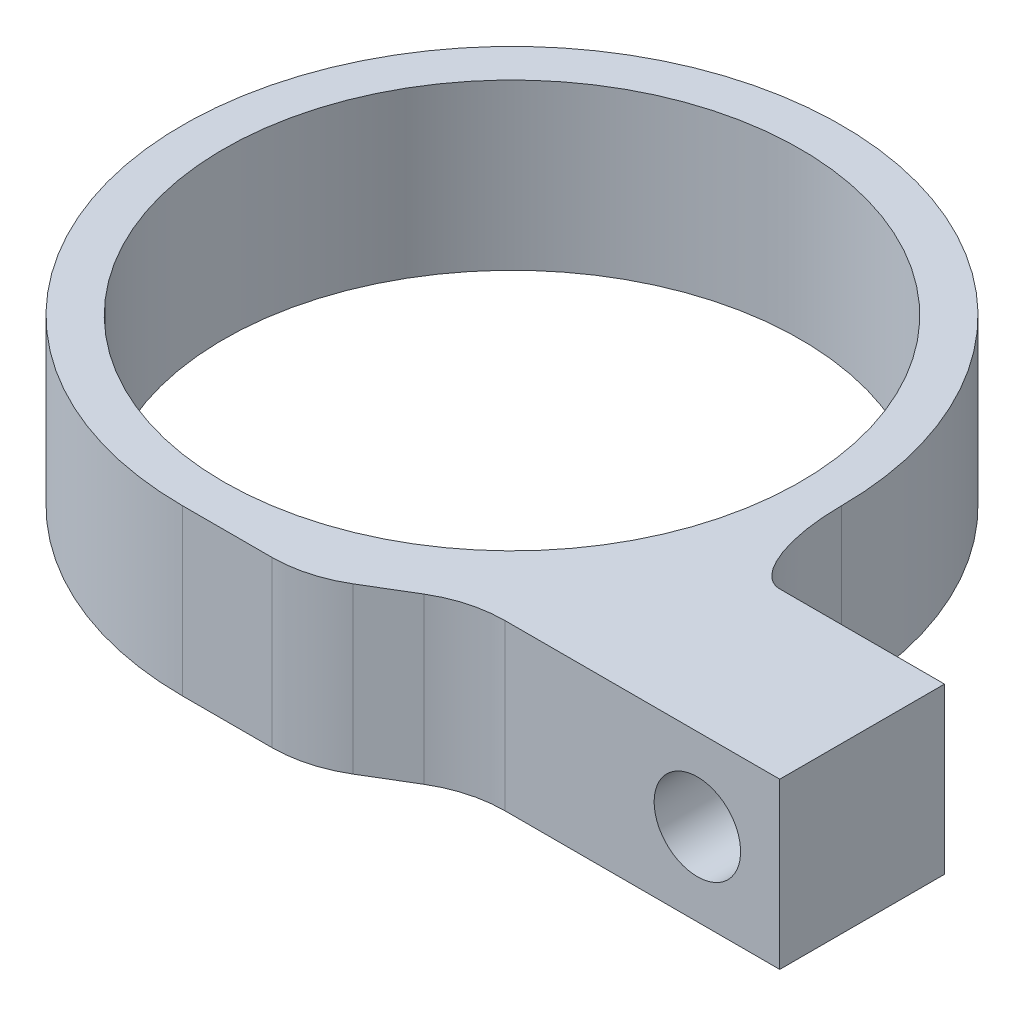
ISO-10303-21;
HEADER;
FILE_DESCRIPTION(('STEP AP214'),'2;1');
FILE_NAME('part.step','',(''),(''),'','','');
FILE_SCHEMA(('AUTOMOTIVE_DESIGN { 1 0 10303 214 1 1 1 1 }'));
ENDSEC;
DATA;
#1=APPLICATION_CONTEXT('core data for automotive mechanical design processes');
#2=APPLICATION_PROTOCOL_DEFINITION('international standard','automotive_design',2000,#1);
#3=PRODUCT_CONTEXT('',#1,'mechanical');
#4=PRODUCT('Part','Part','',(#3));
#5=PRODUCT_RELATED_PRODUCT_CATEGORY('part','',(#4));
#6=PRODUCT_DEFINITION_FORMATION('','',#4);
#7=PRODUCT_DEFINITION_CONTEXT('part definition',#1,'design');
#8=PRODUCT_DEFINITION('design','',#6,#7);
#9=PRODUCT_DEFINITION_SHAPE('','',#8);
#10=(LENGTH_UNIT() NAMED_UNIT(*) SI_UNIT(.MILLI.,.METRE.));
#11=(NAMED_UNIT(*) PLANE_ANGLE_UNIT() SI_UNIT($,.RADIAN.));
#12=(NAMED_UNIT(*) SI_UNIT($,.STERADIAN.) SOLID_ANGLE_UNIT());
#13=UNCERTAINTY_MEASURE_WITH_UNIT(LENGTH_MEASURE(1.E-05),#10,'distance_accuracy_value','');
#14=(GEOMETRIC_REPRESENTATION_CONTEXT(3) GLOBAL_UNCERTAINTY_ASSIGNED_CONTEXT((#13)) GLOBAL_UNIT_ASSIGNED_CONTEXT((#10,
#11,#12)) REPRESENTATION_CONTEXT('',''));
#15=CARTESIAN_POINT('',(0.,0.,0.));
#16=DIRECTION('',(0.,0.,1.));
#17=DIRECTION('',(1.,0.,0.));
#18=AXIS2_PLACEMENT_3D('',#15,#16,#17);
#19=CARTESIAN_POINT('',(0.,8.,0.));
#20=DIRECTION('',(0.,1.,0.));
#21=DIRECTION('',(0.,0.,1.));
#22=AXIS2_PLACEMENT_3D('',#19,#20,#21);
#23=PLANE('',#22);
#24=DIRECTION('',(1.,0.,0.));
#25=VECTOR('',#24,1.);
#26=CARTESIAN_POINT('',(0.,8.,16.));
#27=LINE('',#26,#25);
#28=CARTESIAN_POINT('',(0.,8.,16.));
#29=VERTEX_POINT('',#28);
#30=CARTESIAN_POINT('',(4.3380962103094,8.,16.));
#31=VERTEX_POINT('',#30);
#32=EDGE_CURVE('E120',#29,#31,#27,.T.);
#33=ORIENTED_EDGE('',*,*,#32,.T.);
#34=CARTESIAN_POINT('',(4.3380962103094,8.,10.));
#35=DIRECTION('',(0.,1.,0.));
#36=DIRECTION('',(0.,0.,1.));
#37=AXIS2_PLACEMENT_3D('',#34,#35,#36);
#38=CIRCLE('',#37,6.);
#39=CARTESIAN_POINT('',(7.42507074287456,8.,15.1449575542753));
#40=VERTEX_POINT('',#39);
#41=EDGE_CURVE('E163',#31,#40,#38,.T.);
#42=ORIENTED_EDGE('',*,*,#41,.T.);
#43=DIRECTION('',(0.857492925712544,0.,-0.514495755427526));
#44=VECTOR('',#43,1.);
#45=CARTESIAN_POINT('',(6.,8.,16.));
#46=LINE('',#45,#44);
#47=CARTESIAN_POINT('',(9.57492925712543,8.,13.8550424457247));
#48=VERTEX_POINT('',#47);
#49=EDGE_CURVE('E131',#40,#48,#46,.T.);
#50=ORIENTED_EDGE('',*,*,#49,.T.);
#51=CARTESIAN_POINT('',(12.6619037896906,8.,19.));
#52=DIRECTION('',(0.,1.,0.));
#53=DIRECTION('',(0.,0.,1.));
#54=AXIS2_PLACEMENT_3D('',#51,#52,#53);
#55=CIRCLE('',#54,6.);
#56=CARTESIAN_POINT('',(12.6619037896906,8.,13.));
#57=VERTEX_POINT('',#56);
#58=EDGE_CURVE('E167',#48,#57,#55,.F.);
#59=ORIENTED_EDGE('',*,*,#58,.T.);
#60=DIRECTION('',(1.,0.,0.));
#61=VECTOR('',#60,1.);
#62=CARTESIAN_POINT('',(11.,8.,13.));
#63=LINE('',#62,#61);
#64=CARTESIAN_POINT('',(26.,8.,13.));
#65=VERTEX_POINT('',#64);
#66=EDGE_CURVE('E181',#57,#65,#63,.T.);
#67=ORIENTED_EDGE('',*,*,#66,.T.);
#68=DIRECTION('',(0.,0.,-1.));
#69=VECTOR('',#68,1.);
#70=CARTESIAN_POINT('',(26.,8.,13.));
#71=LINE('',#70,#69);
#72=CARTESIAN_POINT('',(26.,8.,5.));
#73=VERTEX_POINT('',#72);
#74=EDGE_CURVE('E180',#65,#73,#71,.T.);
#75=ORIENTED_EDGE('',*,*,#74,.T.);
#76=DIRECTION('',(-1.,0.,0.));
#77=VECTOR('',#76,1.);
#78=CARTESIAN_POINT('',(26.,8.,5.));
#79=LINE('',#78,#77);
#80=CARTESIAN_POINT('',(18.,8.,5.));
#81=VERTEX_POINT('',#80);
#82=EDGE_CURVE('E172',#73,#81,#79,.T.);
#83=ORIENTED_EDGE('',*,*,#82,.T.);
#84=CARTESIAN_POINT('',(16.,8.,0.));
#85=CARTESIAN_POINT('',(16.,8.,5.));
#86=CARTESIAN_POINT('',(18.,8.,5.));
#87=(BOUNDED_CURVE() B_SPLINE_CURVE(2,(#84,#85,#86),.UNSPECIFIED.,.F.,
.F.) B_SPLINE_CURVE_WITH_KNOTS((3,3),(0.,1.),
.UNSPECIFIED.) CURVE() GEOMETRIC_REPRESENTATION_ITEM() RATIONAL_B_SPLINE_CURVE((1.,
0.707106781186548,1.)) REPRESENTATION_ITEM(''));
#88=CARTESIAN_POINT('',(16.,8.,0.));
#89=VERTEX_POINT('',#88);
#90=EDGE_CURVE('E12',#81,#89,#87,.F.);
#91=ORIENTED_EDGE('',*,*,#90,.T.);
#92=CARTESIAN_POINT('',(0.,8.,0.));
#93=DIRECTION('',(0.,1.,0.));
#94=DIRECTION('',(0.,0.,1.));
#95=AXIS2_PLACEMENT_3D('',#92,#93,#94);
#96=CIRCLE('',#95,16.);
#97=EDGE_CURVE('E132',#89,#29,#96,.T.);
#98=ORIENTED_EDGE('',*,*,#97,.T.);
#99=EDGE_LOOP('',(#33,#42,#50,#59,#67,#75,#83,#91,#98));
#100=FACE_BOUND('',#99,.T.);
#101=CARTESIAN_POINT('',(0.,8.,0.));
#102=DIRECTION('',(0.,1.,0.));
#103=DIRECTION('',(0.,0.,1.));
#104=AXIS2_PLACEMENT_3D('',#101,#102,#103);
#105=CIRCLE('',#104,14.);
#106=CARTESIAN_POINT('',(0.,8.,14.));
#107=VERTEX_POINT('',#106);
#108=EDGE_CURVE('E273',#107,#107,#105,.T.);
#109=ORIENTED_EDGE('',*,*,#108,.F.);
#110=EDGE_LOOP('',(#109));
#111=FACE_BOUND('',#110,.T.);
#112=ADVANCED_FACE('F40',(#100,#111),#23,.T.);
#113=CARTESIAN_POINT('',(0.,0.,0.));
#114=DIRECTION('',(0.,1.,0.));
#115=DIRECTION('',(0.,0.,1.));
#116=AXIS2_PLACEMENT_3D('',#113,#114,#115);
#117=PLANE('',#116);
#118=DIRECTION('',(0.857492925712544,0.,-0.514495755427526));
#119=VECTOR('',#118,1.);
#120=CARTESIAN_POINT('',(6.,0.,16.));
#121=LINE('',#120,#119);
#122=CARTESIAN_POINT('',(7.42507074287456,0.,15.1449575542753));
#123=VERTEX_POINT('',#122);
#124=CARTESIAN_POINT('',(9.57492925712543,0.,13.8550424457247));
#125=VERTEX_POINT('',#124);
#126=EDGE_CURVE('E190',#123,#125,#121,.T.);
#127=ORIENTED_EDGE('',*,*,#126,.F.);
#128=CARTESIAN_POINT('',(4.3380962103094,0.,10.));
#129=DIRECTION('',(0.,1.,0.));
#130=DIRECTION('',(0.,0.,1.));
#131=AXIS2_PLACEMENT_3D('',#128,#129,#130);
#132=CIRCLE('',#131,6.);
#133=CARTESIAN_POINT('',(4.3380962103094,0.,16.));
#134=VERTEX_POINT('',#133);
#135=EDGE_CURVE('E160',#123,#134,#132,.F.);
#136=ORIENTED_EDGE('',*,*,#135,.T.);
#137=DIRECTION('',(1.,0.,0.));
#138=VECTOR('',#137,1.);
#139=CARTESIAN_POINT('',(0.,0.,16.));
#140=LINE('',#139,#138);
#141=CARTESIAN_POINT('',(0.,0.,16.));
#142=VERTEX_POINT('',#141);
#143=EDGE_CURVE('E188',#142,#134,#140,.T.);
#144=ORIENTED_EDGE('',*,*,#143,.F.);
#145=CARTESIAN_POINT('',(0.,0.,0.));
#146=DIRECTION('',(0.,1.,0.));
#147=DIRECTION('',(0.,0.,1.));
#148=AXIS2_PLACEMENT_3D('',#145,#146,#147);
#149=CIRCLE('',#148,16.);
#150=CARTESIAN_POINT('',(16.,0.,0.));
#151=VERTEX_POINT('',#150);
#152=EDGE_CURVE('E144',#151,#142,#149,.T.);
#153=ORIENTED_EDGE('',*,*,#152,.F.);
#154=CARTESIAN_POINT('',(18.,0.,5.));
#155=CARTESIAN_POINT('',(16.,0.,5.));
#156=CARTESIAN_POINT('',(16.,0.,0.));
#157=(BOUNDED_CURVE() B_SPLINE_CURVE(2,(#154,#155,#156),.UNSPECIFIED.,.F.,
.F.) B_SPLINE_CURVE_WITH_KNOTS((3,3),(0.,1.),
.UNSPECIFIED.) CURVE() GEOMETRIC_REPRESENTATION_ITEM() RATIONAL_B_SPLINE_CURVE((1.,
0.707106781186548,1.)) REPRESENTATION_ITEM(''));
#158=CARTESIAN_POINT('',(18.,0.,5.));
#159=VERTEX_POINT('',#158);
#160=EDGE_CURVE('E55',#151,#159,#157,.F.);
#161=ORIENTED_EDGE('',*,*,#160,.T.);
#162=DIRECTION('',(-1.,0.,0.));
#163=VECTOR('',#162,1.);
#164=CARTESIAN_POINT('',(26.,0.,5.));
#165=LINE('',#164,#163);
#166=CARTESIAN_POINT('',(26.,0.,5.));
#167=VERTEX_POINT('',#166);
#168=EDGE_CURVE('E141',#167,#159,#165,.T.);
#169=ORIENTED_EDGE('',*,*,#168,.F.);
#170=DIRECTION('',(0.,0.,-1.));
#171=VECTOR('',#170,1.);
#172=CARTESIAN_POINT('',(26.,0.,13.));
#173=LINE('',#172,#171);
#174=CARTESIAN_POINT('',(26.,0.,13.));
#175=VERTEX_POINT('',#174);
#176=EDGE_CURVE('E171',#175,#167,#173,.T.);
#177=ORIENTED_EDGE('',*,*,#176,.F.);
#178=DIRECTION('',(1.,0.,0.));
#179=VECTOR('',#178,1.);
#180=CARTESIAN_POINT('',(11.,0.,13.));
#181=LINE('',#180,#179);
#182=CARTESIAN_POINT('',(12.6619037896906,0.,13.));
#183=VERTEX_POINT('',#182);
#184=EDGE_CURVE('E192',#183,#175,#181,.T.);
#185=ORIENTED_EDGE('',*,*,#184,.F.);
#186=CARTESIAN_POINT('',(12.6619037896906,0.,19.));
#187=DIRECTION('',(0.,1.,0.));
#188=DIRECTION('',(0.,0.,1.));
#189=AXIS2_PLACEMENT_3D('',#186,#187,#188);
#190=CIRCLE('',#189,6.);
#191=EDGE_CURVE('E165',#183,#125,#190,.T.);
#192=ORIENTED_EDGE('',*,*,#191,.T.);
#193=EDGE_LOOP('',(#127,#136,#144,#153,#161,#169,#177,#185,#192));
#194=FACE_BOUND('',#193,.T.);
#195=CARTESIAN_POINT('',(0.,0.,0.));
#196=DIRECTION('',(0.,1.,0.));
#197=DIRECTION('',(0.,0.,1.));
#198=AXIS2_PLACEMENT_3D('',#195,#196,#197);
#199=CIRCLE('',#198,14.);
#200=CARTESIAN_POINT('',(0.,0.,14.));
#201=VERTEX_POINT('',#200);
#202=EDGE_CURVE('E276',#201,#201,#199,.T.);
#203=ORIENTED_EDGE('',*,*,#202,.T.);
#204=EDGE_LOOP('',(#203));
#205=FACE_BOUND('',#204,.T.);
#206=ADVANCED_FACE('F200',(#194,#205),#117,.F.);
#207=CARTESIAN_POINT('',(0.,8.,0.));
#208=DIRECTION('',(0.,-1.,0.));
#209=DIRECTION('',(0.,0.,-1.));
#210=AXIS2_PLACEMENT_3D('',#207,#208,#209);
#211=CYLINDRICAL_SURFACE('',#210,16.);
#212=ORIENTED_EDGE('',*,*,#152,.T.);
#213=DIRECTION('',(0.,-1.,0.));
#214=VECTOR('',#213,1.);
#215=CARTESIAN_POINT('',(0.,8.,16.));
#216=LINE('',#215,#214);
#217=EDGE_CURVE('E125',#29,#142,#216,.T.);
#218=ORIENTED_EDGE('',*,*,#217,.F.);
#219=ORIENTED_EDGE('',*,*,#97,.F.);
#220=CARTESIAN_POINT('',(16.,-0.399999999999999,0.));
#221=CARTESIAN_POINT('',(16.,2.53333333333334,0.));
#222=CARTESIAN_POINT('',(16.,5.46666666666667,0.));
#223=CARTESIAN_POINT('',(16.,8.4,0.));
#224=(BOUNDED_CURVE() B_SPLINE_CURVE(3,(#220,#221,#222,#223),.UNSPECIFIED.,.F.,
.F.) B_SPLINE_CURVE_WITH_KNOTS((4,4),(-0.0084,0.0004),
.UNSPECIFIED.) CURVE() GEOMETRIC_REPRESENTATION_ITEM() RATIONAL_B_SPLINE_CURVE((1.,1.,1.,1.)) REPRESENTATION_ITEM(''));
#225=EDGE_CURVE('E178',#89,#151,#224,.F.);
#226=ORIENTED_EDGE('',*,*,#225,.T.);
#227=EDGE_LOOP('',(#212,#218,#219,#226));
#228=FACE_BOUND('',#227,.T.);
#229=ADVANCED_FACE('F143',(#228),#211,.T.);
#230=CARTESIAN_POINT('',(0.,8.,16.));
#231=DIRECTION('',(0.,0.,-1.));
#232=DIRECTION('',(-1.,0.,0.));
#233=AXIS2_PLACEMENT_3D('',#230,#231,#232);
#234=PLANE('',#233);
#235=ORIENTED_EDGE('',*,*,#143,.T.);
#236=DIRECTION('',(0.,-1.,0.));
#237=VECTOR('',#236,1.);
#238=CARTESIAN_POINT('',(4.3380962103094,8.,16.));
#239=LINE('',#238,#237);
#240=EDGE_CURVE('E128',#134,#31,#239,.F.);
#241=ORIENTED_EDGE('',*,*,#240,.T.);
#242=ORIENTED_EDGE('',*,*,#32,.F.);
#243=ORIENTED_EDGE('',*,*,#217,.T.);
#244=EDGE_LOOP('',(#235,#241,#242,#243));
#245=FACE_BOUND('',#244,.T.);
#246=ADVANCED_FACE('F123',(#245),#234,.F.);
#247=CARTESIAN_POINT('',(6.,8.,16.));
#248=DIRECTION('',(-0.514495755427526,0.,-0.857492925712544));
#249=DIRECTION('',(-0.857492925712544,0.,0.514495755427526));
#250=AXIS2_PLACEMENT_3D('',#247,#248,#249);
#251=PLANE('',#250);
#252=ORIENTED_EDGE('',*,*,#126,.T.);
#253=DIRECTION('',(0.,-1.,0.));
#254=VECTOR('',#253,1.);
#255=CARTESIAN_POINT('',(9.57492925712544,8.,13.8550424457247));
#256=LINE('',#255,#254);
#257=EDGE_CURVE('E158',#125,#48,#256,.F.);
#258=ORIENTED_EDGE('',*,*,#257,.T.);
#259=ORIENTED_EDGE('',*,*,#49,.F.);
#260=DIRECTION('',(0.,-1.,0.));
#261=VECTOR('',#260,1.);
#262=CARTESIAN_POINT('',(7.42507074287456,8.,15.1449575542753));
#263=LINE('',#262,#261);
#264=EDGE_CURVE('E149',#40,#123,#263,.T.);
#265=ORIENTED_EDGE('',*,*,#264,.T.);
#266=EDGE_LOOP('',(#252,#258,#259,#265));
#267=FACE_BOUND('',#266,.T.);
#268=ADVANCED_FACE('F297',(#267),#251,.F.);
#269=CARTESIAN_POINT('',(11.,8.,13.));
#270=DIRECTION('',(0.,0.,-1.));
#271=DIRECTION('',(-1.,0.,0.));
#272=AXIS2_PLACEMENT_3D('',#269,#270,#271);
#273=PLANE('',#272);
#274=CARTESIAN_POINT('',(22.,4.,13.));
#275=DIRECTION('',(0.,0.,-1.));
#276=DIRECTION('',(-1.,0.,0.));
#277=AXIS2_PLACEMENT_3D('',#274,#275,#276);
#278=CIRCLE('',#277,2.1);
#279=CARTESIAN_POINT('',(19.9,4.,13.));
#280=VERTEX_POINT('',#279);
#281=EDGE_CURVE('E281',#280,#280,#278,.T.);
#282=ORIENTED_EDGE('',*,*,#281,.T.);
#283=EDGE_LOOP('',(#282));
#284=FACE_BOUND('',#283,.T.);
#285=ORIENTED_EDGE('',*,*,#66,.F.);
#286=DIRECTION('',(0.,-1.,0.));
#287=VECTOR('',#286,1.);
#288=CARTESIAN_POINT('',(12.6619037896906,0.,13.));
#289=LINE('',#288,#287);
#290=EDGE_CURVE('E145',#57,#183,#289,.T.);
#291=ORIENTED_EDGE('',*,*,#290,.T.);
#292=ORIENTED_EDGE('',*,*,#184,.T.);
#293=DIRECTION('',(0.,-1.,0.));
#294=VECTOR('',#293,1.);
#295=CARTESIAN_POINT('',(26.,8.,13.));
#296=LINE('',#295,#294);
#297=EDGE_CURVE('E146',#65,#175,#296,.T.);
#298=ORIENTED_EDGE('',*,*,#297,.F.);
#299=EDGE_LOOP('',(#285,#291,#292,#298));
#300=FACE_BOUND('',#299,.T.);
#301=ADVANCED_FACE('F295',(#284,#300),#273,.F.);
#302=CARTESIAN_POINT('',(26.,8.,13.));
#303=DIRECTION('',(-1.,0.,0.));
#304=DIRECTION('',(0.,0.,1.));
#305=AXIS2_PLACEMENT_3D('',#302,#303,#304);
#306=PLANE('',#305);
#307=ORIENTED_EDGE('',*,*,#176,.T.);
#308=DIRECTION('',(0.,-1.,0.));
#309=VECTOR('',#308,1.);
#310=CARTESIAN_POINT('',(26.,8.,5.));
#311=LINE('',#310,#309);
#312=EDGE_CURVE('E152',#73,#167,#311,.T.);
#313=ORIENTED_EDGE('',*,*,#312,.F.);
#314=ORIENTED_EDGE('',*,*,#74,.F.);
#315=ORIENTED_EDGE('',*,*,#297,.T.);
#316=EDGE_LOOP('',(#307,#313,#314,#315));
#317=FACE_BOUND('',#316,.T.);
#318=ADVANCED_FACE('F198',(#317),#306,.F.);
#319=CARTESIAN_POINT('',(26.,8.,5.));
#320=DIRECTION('',(0.,0.,1.));
#321=DIRECTION('',(1.,0.,0.));
#322=AXIS2_PLACEMENT_3D('',#319,#320,#321);
#323=PLANE('',#322);
#324=CARTESIAN_POINT('',(22.,4.,5.));
#325=DIRECTION('',(0.,0.,-1.));
#326=DIRECTION('',(-1.,0.,0.));
#327=AXIS2_PLACEMENT_3D('',#324,#325,#326);
#328=CIRCLE('',#327,2.1);
#329=CARTESIAN_POINT('',(19.9,4.,5.));
#330=VERTEX_POINT('',#329);
#331=EDGE_CURVE('E326',#330,#330,#328,.T.);
#332=ORIENTED_EDGE('',*,*,#331,.F.);
#333=EDGE_LOOP('',(#332));
#334=FACE_BOUND('',#333,.T.);
#335=ORIENTED_EDGE('',*,*,#168,.T.);
#336=CARTESIAN_POINT('',(18.,8.4,5.));
#337=CARTESIAN_POINT('',(18.,5.46666666666667,5.));
#338=CARTESIAN_POINT('',(18.,2.53333333333334,5.));
#339=CARTESIAN_POINT('',(18.,-0.399999999999999,5.));
#340=(BOUNDED_CURVE() B_SPLINE_CURVE(3,(#336,#337,#338,#339),.UNSPECIFIED.,.F.,
.F.) B_SPLINE_CURVE_WITH_KNOTS((4,4),(-0.0084,0.000399999999999999),
.UNSPECIFIED.) CURVE() GEOMETRIC_REPRESENTATION_ITEM() RATIONAL_B_SPLINE_CURVE((1.,1.,1.,1.)) REPRESENTATION_ITEM(''));
#341=EDGE_CURVE('E62',#159,#81,#340,.F.);
#342=ORIENTED_EDGE('',*,*,#341,.T.);
#343=ORIENTED_EDGE('',*,*,#82,.F.);
#344=ORIENTED_EDGE('',*,*,#312,.T.);
#345=EDGE_LOOP('',(#335,#342,#343,#344));
#346=FACE_BOUND('',#345,.T.);
#347=ADVANCED_FACE('F202',(#334,#346),#323,.F.);
#348=CARTESIAN_POINT('',(0.,8.,0.));
#349=DIRECTION('',(0.,-1.,0.));
#350=DIRECTION('',(0.,0.,-1.));
#351=AXIS2_PLACEMENT_3D('',#348,#349,#350);
#352=CYLINDRICAL_SURFACE('',#351,14.);
#353=ORIENTED_EDGE('',*,*,#108,.T.);
#354=EDGE_LOOP('',(#353));
#355=FACE_BOUND('',#354,.T.);
#356=ORIENTED_EDGE('',*,*,#202,.F.);
#357=EDGE_LOOP('',(#356));
#358=FACE_BOUND('',#357,.T.);
#359=ADVANCED_FACE('F256',(#355,#358),#352,.F.);
#360=CARTESIAN_POINT('',(12.6619037896906,8.,19.));
#361=DIRECTION('',(0.,1.,0.));
#362=DIRECTION('',(0.,0.,1.));
#363=AXIS2_PLACEMENT_3D('',#360,#361,#362);
#364=CYLINDRICAL_SURFACE('',#363,6.);
#365=ORIENTED_EDGE('',*,*,#58,.F.);
#366=ORIENTED_EDGE('',*,*,#257,.F.);
#367=ORIENTED_EDGE('',*,*,#191,.F.);
#368=ORIENTED_EDGE('',*,*,#290,.F.);
#369=EDGE_LOOP('',(#365,#366,#367,#368));
#370=FACE_BOUND('',#369,.T.);
#371=ADVANCED_FACE('F294',(#370),#364,.F.);
#372=CARTESIAN_POINT('',(4.3380962103094,8.,10.));
#373=DIRECTION('',(0.,-1.,0.));
#374=DIRECTION('',(0.,0.,-1.));
#375=AXIS2_PLACEMENT_3D('',#372,#373,#374);
#376=CYLINDRICAL_SURFACE('',#375,6.);
#377=ORIENTED_EDGE('',*,*,#41,.F.);
#378=ORIENTED_EDGE('',*,*,#240,.F.);
#379=ORIENTED_EDGE('',*,*,#135,.F.);
#380=ORIENTED_EDGE('',*,*,#264,.F.);
#381=EDGE_LOOP('',(#377,#378,#379,#380));
#382=FACE_BOUND('',#381,.T.);
#383=ADVANCED_FACE('F312',(#382),#376,.T.);
#384=CARTESIAN_POINT('',(22.,4.,16.));
#385=DIRECTION('',(0.,0.,-1.));
#386=DIRECTION('',(-1.,0.,0.));
#387=AXIS2_PLACEMENT_3D('',#384,#385,#386);
#388=CYLINDRICAL_SURFACE('',#387,2.1);
#389=ORIENTED_EDGE('',*,*,#331,.T.);
#390=EDGE_LOOP('',(#389));
#391=FACE_BOUND('',#390,.T.);
#392=ORIENTED_EDGE('',*,*,#281,.F.);
#393=EDGE_LOOP('',(#392));
#394=FACE_BOUND('',#393,.T.);
#395=ADVANCED_FACE('F314',(#391,#394),#388,.F.);
#396=CARTESIAN_POINT('',(18.,-0.399999999999999,5.));
#397=CARTESIAN_POINT('',(18.,2.53333333333334,5.));
#398=CARTESIAN_POINT('',(18.,5.46666666666667,5.));
#399=CARTESIAN_POINT('',(18.,8.4,5.));
#400=CARTESIAN_POINT('',(16.,-0.399999999999999,5.));
#401=CARTESIAN_POINT('',(16.,2.53333333333334,5.));
#402=CARTESIAN_POINT('',(16.,5.46666666666667,5.));
#403=CARTESIAN_POINT('',(16.,8.4,5.));
#404=CARTESIAN_POINT('',(16.,-0.399999999999999,0.));
#405=CARTESIAN_POINT('',(16.,2.53333333333334,0.));
#406=CARTESIAN_POINT('',(16.,5.46666666666667,0.));
#407=CARTESIAN_POINT('',(16.,8.4,0.));
#408=(BOUNDED_SURFACE() B_SPLINE_SURFACE(2,3,((#396,#397,#398,#399),(#400,#401,#402,#403),(#404,
#405,#406,#407)),.UNSPECIFIED.,.F.,.F.,.F.) B_SPLINE_SURFACE_WITH_KNOTS((3,3),(4,4),(0.,1.),
(-0.0084,0.0004),.UNSPECIFIED.) GEOMETRIC_REPRESENTATION_ITEM() RATIONAL_B_SPLINE_SURFACE(((1.,
1.,1.,1.),(0.707106781186548,0.707106781186548,0.707106781186548,0.707106781186548),(1.,1.,1.,1.))) REPRESENTATION_ITEM('') SURFACE());
#409=ORIENTED_EDGE('',*,*,#90,.F.);
#410=ORIENTED_EDGE('',*,*,#341,.F.);
#411=ORIENTED_EDGE('',*,*,#160,.F.);
#412=ORIENTED_EDGE('',*,*,#225,.F.);
#413=EDGE_LOOP('',(#409,#410,#411,#412));
#414=FACE_BOUND('',#413,.T.);
#415=ADVANCED_FACE('F43',(#414),#408,.T.);
#416=CLOSED_SHELL('',(#112,#206,#229,#246,#268,#301,#318,#347,#359,#371,#383,#395,#415));
#417=MANIFOLD_SOLID_BREP('B2',#416);
#418=ADVANCED_BREP_SHAPE_REPRESENTATION('',(#18,#417),#14);
#419=SHAPE_DEFINITION_REPRESENTATION(#9,#418);
ENDSEC;
END-ISO-10303-21;
